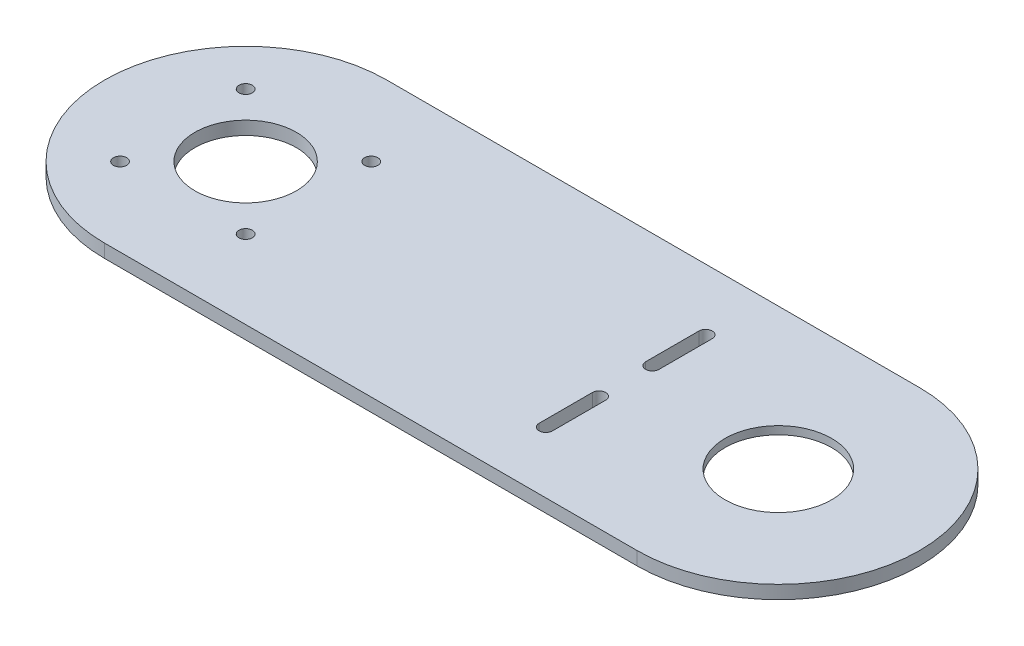
ISO-10303-21;
HEADER;
FILE_DESCRIPTION(('STEP AP214'),'2;1');
FILE_NAME('part.step','',(''),(''),'','','');
FILE_SCHEMA(('AUTOMOTIVE_DESIGN { 1 0 10303 214 1 1 1 1 }'));
ENDSEC;
DATA;
#1=APPLICATION_CONTEXT('core data for automotive mechanical design processes');
#2=APPLICATION_PROTOCOL_DEFINITION('international standard','automotive_design',2000,#1);
#3=PRODUCT_CONTEXT('',#1,'mechanical');
#4=PRODUCT('Part','Part','',(#3));
#5=PRODUCT_RELATED_PRODUCT_CATEGORY('part','',(#4));
#6=PRODUCT_DEFINITION_FORMATION('','',#4);
#7=PRODUCT_DEFINITION_CONTEXT('part definition',#1,'design');
#8=PRODUCT_DEFINITION('design','',#6,#7);
#9=PRODUCT_DEFINITION_SHAPE('','',#8);
#10=(LENGTH_UNIT() NAMED_UNIT(*) SI_UNIT(.MILLI.,.METRE.));
#11=(NAMED_UNIT(*) PLANE_ANGLE_UNIT() SI_UNIT($,.RADIAN.));
#12=(NAMED_UNIT(*) SI_UNIT($,.STERADIAN.) SOLID_ANGLE_UNIT());
#13=UNCERTAINTY_MEASURE_WITH_UNIT(LENGTH_MEASURE(1.E-05),#10,'distance_accuracy_value','');
#14=(GEOMETRIC_REPRESENTATION_CONTEXT(3) GLOBAL_UNCERTAINTY_ASSIGNED_CONTEXT((#13)) GLOBAL_UNIT_ASSIGNED_CONTEXT((#10,
#11,#12)) REPRESENTATION_CONTEXT('',''));
#15=CARTESIAN_POINT('',(0.,0.,0.));
#16=DIRECTION('',(0.,0.,1.));
#17=DIRECTION('',(1.,0.,0.));
#18=AXIS2_PLACEMENT_3D('',#15,#16,#17);
#19=CARTESIAN_POINT('',(100.,0.,0.));
#20=DIRECTION('',(0.,1.,0.));
#21=DIRECTION('',(0.,0.,1.));
#22=AXIS2_PLACEMENT_3D('',#19,#20,#21);
#23=CYLINDRICAL_SURFACE('',#22,20.);
#24=CARTESIAN_POINT('',(100.,5.,0.));
#25=DIRECTION('',(0.,1.,0.));
#26=DIRECTION('',(0.,0.,1.));
#27=AXIS2_PLACEMENT_3D('',#24,#25,#26);
#28=CIRCLE('',#27,20.);
#29=CARTESIAN_POINT('',(100.,5.,20.));
#30=VERTEX_POINT('',#29);
#31=EDGE_CURVE('E210',#30,#30,#28,.T.);
#32=ORIENTED_EDGE('',*,*,#31,.T.);
#33=EDGE_LOOP('',(#32));
#34=FACE_BOUND('',#33,.T.);
#35=CARTESIAN_POINT('',(100.,2.,0.));
#36=DIRECTION('',(0.,-1.,0.));
#37=DIRECTION('',(0.,0.,-1.));
#38=AXIS2_PLACEMENT_3D('',#35,#36,#37);
#39=CIRCLE('',#38,20.);
#40=CARTESIAN_POINT('',(100.,2.,-20.));
#41=VERTEX_POINT('',#40);
#42=EDGE_CURVE('E39',#41,#41,#39,.F.);
#43=ORIENTED_EDGE('',*,*,#42,.F.);
#44=EDGE_LOOP('',(#43));
#45=FACE_BOUND('',#44,.T.);
#46=ADVANCED_FACE('F35',(#34,#45),#23,.F.);
#47=CARTESIAN_POINT('',(-100.,5.,0.));
#48=DIRECTION('',(0.,-1.,0.));
#49=DIRECTION('',(0.,0.,-1.));
#50=AXIS2_PLACEMENT_3D('',#47,#48,#49);
#51=CYLINDRICAL_SURFACE('',#50,53.);
#52=CARTESIAN_POINT('',(-100.,0.,0.));
#53=DIRECTION('',(0.,1.,0.));
#54=DIRECTION('',(0.,0.,1.));
#55=AXIS2_PLACEMENT_3D('',#52,#53,#54);
#56=CIRCLE('',#55,53.);
#57=CARTESIAN_POINT('',(-100.,0.,-53.));
#58=VERTEX_POINT('',#57);
#59=CARTESIAN_POINT('',(-100.,0.,53.));
#60=VERTEX_POINT('',#59);
#61=EDGE_CURVE('E213',#58,#60,#56,.T.);
#62=ORIENTED_EDGE('',*,*,#61,.T.);
#63=DIRECTION('',(0.,-1.,0.));
#64=VECTOR('',#63,1.);
#65=CARTESIAN_POINT('',(-100.,5.,53.));
#66=LINE('',#65,#64);
#67=CARTESIAN_POINT('',(-100.,5.,53.));
#68=VERTEX_POINT('',#67);
#69=EDGE_CURVE('E11',#68,#60,#66,.T.);
#70=ORIENTED_EDGE('',*,*,#69,.F.);
#71=CARTESIAN_POINT('',(-100.,5.,0.));
#72=DIRECTION('',(0.,1.,0.));
#73=DIRECTION('',(0.,0.,1.));
#74=AXIS2_PLACEMENT_3D('',#71,#72,#73);
#75=CIRCLE('',#74,53.);
#76=CARTESIAN_POINT('',(-100.,5.,-53.));
#77=VERTEX_POINT('',#76);
#78=EDGE_CURVE('E214',#77,#68,#75,.T.);
#79=ORIENTED_EDGE('',*,*,#78,.F.);
#80=DIRECTION('',(0.,-1.,0.));
#81=VECTOR('',#80,1.);
#82=CARTESIAN_POINT('',(-100.,5.,-53.));
#83=LINE('',#82,#81);
#84=EDGE_CURVE('E225',#77,#58,#83,.T.);
#85=ORIENTED_EDGE('',*,*,#84,.T.);
#86=EDGE_LOOP('',(#62,#70,#79,#85));
#87=FACE_BOUND('',#86,.T.);
#88=ADVANCED_FACE('F37',(#87),#51,.T.);
#89=CARTESIAN_POINT('',(0.,5.,53.));
#90=DIRECTION('',(0.,0.,-1.));
#91=DIRECTION('',(-1.,0.,0.));
#92=AXIS2_PLACEMENT_3D('',#89,#90,#91);
#93=PLANE('',#92);
#94=DIRECTION('',(1.,0.,0.));
#95=VECTOR('',#94,1.);
#96=CARTESIAN_POINT('',(0.,0.,53.));
#97=LINE('',#96,#95);
#98=CARTESIAN_POINT('',(100.,0.,53.));
#99=VERTEX_POINT('',#98);
#100=EDGE_CURVE('E228',#60,#99,#97,.T.);
#101=ORIENTED_EDGE('',*,*,#100,.T.);
#102=DIRECTION('',(0.,-1.,0.));
#103=VECTOR('',#102,1.);
#104=CARTESIAN_POINT('',(100.,5.,53.));
#105=LINE('',#104,#103);
#106=CARTESIAN_POINT('',(100.,5.,53.));
#107=VERTEX_POINT('',#106);
#108=EDGE_CURVE('E44',#107,#99,#105,.T.);
#109=ORIENTED_EDGE('',*,*,#108,.F.);
#110=DIRECTION('',(1.,0.,0.));
#111=VECTOR('',#110,1.);
#112=CARTESIAN_POINT('',(0.,5.,53.));
#113=LINE('',#112,#111);
#114=EDGE_CURVE('E217',#68,#107,#113,.T.);
#115=ORIENTED_EDGE('',*,*,#114,.F.);
#116=ORIENTED_EDGE('',*,*,#69,.T.);
#117=EDGE_LOOP('',(#101,#109,#115,#116));
#118=FACE_BOUND('',#117,.T.);
#119=ADVANCED_FACE('F256',(#118),#93,.F.);
#120=CARTESIAN_POINT('',(100.,5.,0.));
#121=DIRECTION('',(0.,-1.,0.));
#122=DIRECTION('',(0.,0.,-1.));
#123=AXIS2_PLACEMENT_3D('',#120,#121,#122);
#124=CYLINDRICAL_SURFACE('',#123,53.);
#125=CARTESIAN_POINT('',(100.,0.,0.));
#126=DIRECTION('',(0.,1.,0.));
#127=DIRECTION('',(0.,0.,1.));
#128=AXIS2_PLACEMENT_3D('',#125,#126,#127);
#129=CIRCLE('',#128,53.);
#130=CARTESIAN_POINT('',(100.,0.,-53.));
#131=VERTEX_POINT('',#130);
#132=EDGE_CURVE('E230',#99,#131,#129,.T.);
#133=ORIENTED_EDGE('',*,*,#132,.T.);
#134=DIRECTION('',(0.,-1.,0.));
#135=VECTOR('',#134,1.);
#136=CARTESIAN_POINT('',(100.,5.,-53.));
#137=LINE('',#136,#135);
#138=CARTESIAN_POINT('',(100.,5.,-53.));
#139=VERTEX_POINT('',#138);
#140=EDGE_CURVE('E236',#139,#131,#137,.T.);
#141=ORIENTED_EDGE('',*,*,#140,.F.);
#142=CARTESIAN_POINT('',(100.,5.,0.));
#143=DIRECTION('',(0.,1.,0.));
#144=DIRECTION('',(0.,0.,1.));
#145=AXIS2_PLACEMENT_3D('',#142,#143,#144);
#146=CIRCLE('',#145,53.);
#147=EDGE_CURVE('E220',#107,#139,#146,.T.);
#148=ORIENTED_EDGE('',*,*,#147,.F.);
#149=ORIENTED_EDGE('',*,*,#108,.T.);
#150=EDGE_LOOP('',(#133,#141,#148,#149));
#151=FACE_BOUND('',#150,.T.);
#152=ADVANCED_FACE('F243',(#151),#124,.T.);
#153=CARTESIAN_POINT('',(0.,5.,-53.));
#154=DIRECTION('',(0.,0.,-1.));
#155=DIRECTION('',(-1.,0.,0.));
#156=AXIS2_PLACEMENT_3D('',#153,#154,#155);
#157=PLANE('',#156);
#158=DIRECTION('',(1.,0.,0.));
#159=VECTOR('',#158,1.);
#160=CARTESIAN_POINT('',(0.,0.,-53.));
#161=LINE('',#160,#159);
#162=EDGE_CURVE('E218',#58,#131,#161,.T.);
#163=ORIENTED_EDGE('',*,*,#162,.F.);
#164=ORIENTED_EDGE('',*,*,#84,.F.);
#165=DIRECTION('',(1.,0.,0.));
#166=VECTOR('',#165,1.);
#167=CARTESIAN_POINT('',(0.,5.,-53.));
#168=LINE('',#167,#166);
#169=EDGE_CURVE('E222',#77,#139,#168,.T.);
#170=ORIENTED_EDGE('',*,*,#169,.T.);
#171=ORIENTED_EDGE('',*,*,#140,.T.);
#172=EDGE_LOOP('',(#163,#164,#170,#171));
#173=FACE_BOUND('',#172,.T.);
#174=ADVANCED_FACE('F250',(#173),#157,.T.);
#175=CARTESIAN_POINT('',(0.,5.,0.));
#176=DIRECTION('',(0.,1.,0.));
#177=DIRECTION('',(0.,0.,1.));
#178=AXIS2_PLACEMENT_3D('',#175,#176,#177);
#179=PLANE('',#178);
#180=CARTESIAN_POINT('',(42.6826386405906,5.,10.));
#181=DIRECTION('',(0.,1.,0.));
#182=DIRECTION('',(0.,0.,1.));
#183=AXIS2_PLACEMENT_3D('',#180,#181,#182);
#184=CIRCLE('',#183,2.49999999999999);
#185=CARTESIAN_POINT('',(45.1826386405906,5.,10.));
#186=VERTEX_POINT('',#185);
#187=CARTESIAN_POINT('',(40.1826386405906,5.,10.));
#188=VERTEX_POINT('',#187);
#189=EDGE_CURVE('E51',#186,#188,#184,.T.);
#190=ORIENTED_EDGE('',*,*,#189,.F.);
#191=DIRECTION('',(0.,0.,-1.));
#192=VECTOR('',#191,1.);
#193=CARTESIAN_POINT('',(45.1826386405906,5.,10.));
#194=LINE('',#193,#192);
#195=CARTESIAN_POINT('',(45.1826386405906,5.,30.));
#196=VERTEX_POINT('',#195);
#197=EDGE_CURVE('E172',#196,#186,#194,.T.);
#198=ORIENTED_EDGE('',*,*,#197,.F.);
#199=CARTESIAN_POINT('',(42.6826386405906,5.,30.));
#200=DIRECTION('',(0.,1.,0.));
#201=DIRECTION('',(0.,0.,1.));
#202=AXIS2_PLACEMENT_3D('',#199,#200,#201);
#203=CIRCLE('',#202,2.49999999999999);
#204=CARTESIAN_POINT('',(40.1826386405906,5.,30.));
#205=VERTEX_POINT('',#204);
#206=EDGE_CURVE('E186',#205,#196,#203,.T.);
#207=ORIENTED_EDGE('',*,*,#206,.F.);
#208=DIRECTION('',(0.,0.,1.));
#209=VECTOR('',#208,1.);
#210=CARTESIAN_POINT('',(40.1826386405906,5.,10.));
#211=LINE('',#210,#209);
#212=EDGE_CURVE('E183',#188,#205,#211,.T.);
#213=ORIENTED_EDGE('',*,*,#212,.F.);
#214=EDGE_LOOP('',(#190,#198,#207,#213));
#215=FACE_BOUND('',#214,.T.);
#216=CARTESIAN_POINT('',(42.6826386405906,5.,-30.));
#217=DIRECTION('',(0.,1.,0.));
#218=DIRECTION('',(0.,0.,-1.));
#219=AXIS2_PLACEMENT_3D('',#216,#217,#218);
#220=CIRCLE('',#219,2.49999999999999);
#221=CARTESIAN_POINT('',(45.1826386405906,5.,-30.));
#222=VERTEX_POINT('',#221);
#223=CARTESIAN_POINT('',(40.1826386405906,5.,-30.));
#224=VERTEX_POINT('',#223);
#225=EDGE_CURVE('E59',#222,#224,#220,.T.);
#226=ORIENTED_EDGE('',*,*,#225,.F.);
#227=DIRECTION('',(0.,0.,-1.));
#228=VECTOR('',#227,1.);
#229=CARTESIAN_POINT('',(45.1826386405906,5.,-10.));
#230=LINE('',#229,#228);
#231=CARTESIAN_POINT('',(45.1826386405906,5.,-10.));
#232=VERTEX_POINT('',#231);
#233=EDGE_CURVE('E146',#232,#222,#230,.T.);
#234=ORIENTED_EDGE('',*,*,#233,.F.);
#235=CARTESIAN_POINT('',(42.6826386405906,5.,-10.));
#236=DIRECTION('',(0.,1.,0.));
#237=DIRECTION('',(0.,0.,-1.));
#238=AXIS2_PLACEMENT_3D('',#235,#236,#237);
#239=CIRCLE('',#238,2.49999999999999);
#240=CARTESIAN_POINT('',(40.1826386405906,5.,-10.));
#241=VERTEX_POINT('',#240);
#242=EDGE_CURVE('E149',#241,#232,#239,.T.);
#243=ORIENTED_EDGE('',*,*,#242,.F.);
#244=DIRECTION('',(0.,0.,1.));
#245=VECTOR('',#244,1.);
#246=CARTESIAN_POINT('',(40.1826386405906,5.,-10.));
#247=LINE('',#246,#245);
#248=EDGE_CURVE('E158',#224,#241,#247,.T.);
#249=ORIENTED_EDGE('',*,*,#248,.F.);
#250=EDGE_LOOP('',(#226,#234,#243,#249));
#251=FACE_BOUND('',#250,.T.);
#252=CARTESIAN_POINT('',(-100.,5.,0.));
#253=DIRECTION('',(0.,1.,0.));
#254=DIRECTION('',(0.,0.,1.));
#255=AXIS2_PLACEMENT_3D('',#252,#253,#254);
#256=CIRCLE('',#255,19.05);
#257=CARTESIAN_POINT('',(-100.,5.,19.05));
#258=VERTEX_POINT('',#257);
#259=EDGE_CURVE('E152',#258,#258,#256,.T.);
#260=ORIENTED_EDGE('',*,*,#259,.F.);
#261=EDGE_LOOP('',(#260));
#262=FACE_BOUND('',#261,.T.);
#263=CARTESIAN_POINT('',(-123.57,5.,23.57));
#264=DIRECTION('',(0.,1.,0.));
#265=DIRECTION('',(0.,0.,1.));
#266=AXIS2_PLACEMENT_3D('',#263,#264,#265);
#267=CIRCLE('',#266,2.50000000000001);
#268=CARTESIAN_POINT('',(-123.57,5.,26.07));
#269=VERTEX_POINT('',#268);
#270=EDGE_CURVE('E489',#269,#269,#267,.T.);
#271=ORIENTED_EDGE('',*,*,#270,.F.);
#272=EDGE_LOOP('',(#271));
#273=FACE_BOUND('',#272,.T.);
#274=CARTESIAN_POINT('',(-76.43,5.,23.57));
#275=DIRECTION('',(0.,1.,0.));
#276=DIRECTION('',(0.,0.,1.));
#277=AXIS2_PLACEMENT_3D('',#274,#275,#276);
#278=CIRCLE('',#277,2.5);
#279=CARTESIAN_POINT('',(-76.43,5.,26.07));
#280=VERTEX_POINT('',#279);
#281=EDGE_CURVE('E493',#280,#280,#278,.T.);
#282=ORIENTED_EDGE('',*,*,#281,.F.);
#283=EDGE_LOOP('',(#282));
#284=FACE_BOUND('',#283,.T.);
#285=CARTESIAN_POINT('',(-76.43,5.,-23.57));
#286=DIRECTION('',(0.,1.,0.));
#287=DIRECTION('',(0.,0.,1.));
#288=AXIS2_PLACEMENT_3D('',#285,#286,#287);
#289=CIRCLE('',#288,2.50000000000001);
#290=CARTESIAN_POINT('',(-76.43,5.,-21.07));
#291=VERTEX_POINT('',#290);
#292=EDGE_CURVE('E497',#291,#291,#289,.T.);
#293=ORIENTED_EDGE('',*,*,#292,.F.);
#294=EDGE_LOOP('',(#293));
#295=FACE_BOUND('',#294,.T.);
#296=CARTESIAN_POINT('',(-123.57,5.,-23.57));
#297=DIRECTION('',(0.,1.,0.));
#298=DIRECTION('',(0.,0.,1.));
#299=AXIS2_PLACEMENT_3D('',#296,#297,#298);
#300=CIRCLE('',#299,2.50000000000001);
#301=CARTESIAN_POINT('',(-123.57,5.,-21.07));
#302=VERTEX_POINT('',#301);
#303=EDGE_CURVE('E201',#302,#302,#300,.T.);
#304=ORIENTED_EDGE('',*,*,#303,.F.);
#305=EDGE_LOOP('',(#304));
#306=FACE_BOUND('',#305,.T.);
#307=ORIENTED_EDGE('',*,*,#31,.F.);
#308=EDGE_LOOP('',(#307));
#309=FACE_BOUND('',#308,.T.);
#310=ORIENTED_EDGE('',*,*,#78,.T.);
#311=ORIENTED_EDGE('',*,*,#114,.T.);
#312=ORIENTED_EDGE('',*,*,#147,.T.);
#313=ORIENTED_EDGE('',*,*,#169,.F.);
#314=EDGE_LOOP('',(#310,#311,#312,#313));
#315=FACE_BOUND('',#314,.T.);
#316=ADVANCED_FACE('F254',(#215,#251,#262,#273,#284,#295,#306,#309,#315),#179,.T.);
#317=CARTESIAN_POINT('',(0.,0.,0.));
#318=DIRECTION('',(0.,1.,0.));
#319=DIRECTION('',(0.,0.,1.));
#320=AXIS2_PLACEMENT_3D('',#317,#318,#319);
#321=PLANE('',#320);
#322=DIRECTION('',(0.,0.,-1.));
#323=VECTOR('',#322,1.);
#324=CARTESIAN_POINT('',(45.1826386405906,0.,10.));
#325=LINE('',#324,#323);
#326=CARTESIAN_POINT('',(45.1826386405906,0.,30.));
#327=VERTEX_POINT('',#326);
#328=CARTESIAN_POINT('',(45.1826386405906,0.,10.));
#329=VERTEX_POINT('',#328);
#330=EDGE_CURVE('E178',#327,#329,#325,.T.);
#331=ORIENTED_EDGE('',*,*,#330,.T.);
#332=CARTESIAN_POINT('',(42.6826386405906,0.,10.));
#333=DIRECTION('',(0.,1.,0.));
#334=DIRECTION('',(0.,0.,1.));
#335=AXIS2_PLACEMENT_3D('',#332,#333,#334);
#336=CIRCLE('',#335,2.49999999999999);
#337=CARTESIAN_POINT('',(40.1826386405906,0.,10.));
#338=VERTEX_POINT('',#337);
#339=EDGE_CURVE('E168',#329,#338,#336,.T.);
#340=ORIENTED_EDGE('',*,*,#339,.T.);
#341=DIRECTION('',(0.,0.,1.));
#342=VECTOR('',#341,1.);
#343=CARTESIAN_POINT('',(40.1826386405906,0.,10.));
#344=LINE('',#343,#342);
#345=CARTESIAN_POINT('',(40.1826386405906,0.,30.));
#346=VERTEX_POINT('',#345);
#347=EDGE_CURVE('E171',#338,#346,#344,.T.);
#348=ORIENTED_EDGE('',*,*,#347,.T.);
#349=CARTESIAN_POINT('',(42.6826386405906,0.,30.));
#350=DIRECTION('',(0.,1.,0.));
#351=DIRECTION('',(0.,0.,1.));
#352=AXIS2_PLACEMENT_3D('',#349,#350,#351);
#353=CIRCLE('',#352,2.49999999999999);
#354=EDGE_CURVE('E175',#346,#327,#353,.T.);
#355=ORIENTED_EDGE('',*,*,#354,.T.);
#356=EDGE_LOOP('',(#331,#340,#348,#355));
#357=FACE_BOUND('',#356,.T.);
#358=DIRECTION('',(0.,0.,-1.));
#359=VECTOR('',#358,1.);
#360=CARTESIAN_POINT('',(45.1826386405906,0.,-10.));
#361=LINE('',#360,#359);
#362=CARTESIAN_POINT('',(45.1826386405906,0.,-10.));
#363=VERTEX_POINT('',#362);
#364=CARTESIAN_POINT('',(45.1826386405906,0.,-30.));
#365=VERTEX_POINT('',#364);
#366=EDGE_CURVE('E133',#363,#365,#361,.T.);
#367=ORIENTED_EDGE('',*,*,#366,.T.);
#368=CARTESIAN_POINT('',(42.6826386405906,0.,-30.));
#369=DIRECTION('',(0.,1.,0.));
#370=DIRECTION('',(0.,0.,-1.));
#371=AXIS2_PLACEMENT_3D('',#368,#369,#370);
#372=CIRCLE('',#371,2.49999999999999);
#373=CARTESIAN_POINT('',(40.1826386405906,0.,-30.));
#374=VERTEX_POINT('',#373);
#375=EDGE_CURVE('E127',#365,#374,#372,.T.);
#376=ORIENTED_EDGE('',*,*,#375,.T.);
#377=DIRECTION('',(0.,0.,1.));
#378=VECTOR('',#377,1.);
#379=CARTESIAN_POINT('',(40.1826386405906,0.,-10.));
#380=LINE('',#379,#378);
#381=CARTESIAN_POINT('',(40.1826386405906,0.,-10.));
#382=VERTEX_POINT('',#381);
#383=EDGE_CURVE('E137',#374,#382,#380,.T.);
#384=ORIENTED_EDGE('',*,*,#383,.T.);
#385=CARTESIAN_POINT('',(42.6826386405906,0.,-10.));
#386=DIRECTION('',(0.,1.,0.));
#387=DIRECTION('',(0.,0.,-1.));
#388=AXIS2_PLACEMENT_3D('',#385,#386,#387);
#389=CIRCLE('',#388,2.49999999999999);
#390=EDGE_CURVE('E141',#382,#363,#389,.T.);
#391=ORIENTED_EDGE('',*,*,#390,.T.);
#392=EDGE_LOOP('',(#367,#376,#384,#391));
#393=FACE_BOUND('',#392,.T.);
#394=CARTESIAN_POINT('',(-100.,0.,0.));
#395=DIRECTION('',(0.,1.,0.));
#396=DIRECTION('',(0.,0.,1.));
#397=AXIS2_PLACEMENT_3D('',#394,#395,#396);
#398=CIRCLE('',#397,19.05);
#399=CARTESIAN_POINT('',(-100.,0.,19.05));
#400=VERTEX_POINT('',#399);
#401=EDGE_CURVE('E514',#400,#400,#398,.T.);
#402=ORIENTED_EDGE('',*,*,#401,.T.);
#403=EDGE_LOOP('',(#402));
#404=FACE_BOUND('',#403,.T.);
#405=CARTESIAN_POINT('',(-123.57,0.,23.57));
#406=DIRECTION('',(0.,1.,0.));
#407=DIRECTION('',(0.,0.,1.));
#408=AXIS2_PLACEMENT_3D('',#405,#406,#407);
#409=CIRCLE('',#408,2.50000000000001);
#410=CARTESIAN_POINT('',(-123.57,0.,26.07));
#411=VERTEX_POINT('',#410);
#412=EDGE_CURVE('E511',#411,#411,#409,.T.);
#413=ORIENTED_EDGE('',*,*,#412,.T.);
#414=EDGE_LOOP('',(#413));
#415=FACE_BOUND('',#414,.T.);
#416=CARTESIAN_POINT('',(-76.43,0.,23.57));
#417=DIRECTION('',(0.,1.,0.));
#418=DIRECTION('',(0.,0.,1.));
#419=AXIS2_PLACEMENT_3D('',#416,#417,#418);
#420=CIRCLE('',#419,2.5);
#421=CARTESIAN_POINT('',(-76.43,0.,26.07));
#422=VERTEX_POINT('',#421);
#423=EDGE_CURVE('E503',#422,#422,#420,.T.);
#424=ORIENTED_EDGE('',*,*,#423,.T.);
#425=EDGE_LOOP('',(#424));
#426=FACE_BOUND('',#425,.T.);
#427=CARTESIAN_POINT('',(-76.43,0.,-23.57));
#428=DIRECTION('',(0.,1.,0.));
#429=DIRECTION('',(0.,0.,1.));
#430=AXIS2_PLACEMENT_3D('',#427,#428,#429);
#431=CIRCLE('',#430,2.50000000000001);
#432=CARTESIAN_POINT('',(-76.43,0.,-21.07));
#433=VERTEX_POINT('',#432);
#434=EDGE_CURVE('E204',#433,#433,#431,.T.);
#435=ORIENTED_EDGE('',*,*,#434,.T.);
#436=EDGE_LOOP('',(#435));
#437=FACE_BOUND('',#436,.T.);
#438=CARTESIAN_POINT('',(-123.57,0.,-23.57));
#439=DIRECTION('',(0.,1.,0.));
#440=DIRECTION('',(0.,0.,1.));
#441=AXIS2_PLACEMENT_3D('',#438,#439,#440);
#442=CIRCLE('',#441,2.50000000000001);
#443=CARTESIAN_POINT('',(-123.57,0.,-21.07));
#444=VERTEX_POINT('',#443);
#445=EDGE_CURVE('E197',#444,#444,#442,.T.);
#446=ORIENTED_EDGE('',*,*,#445,.T.);
#447=EDGE_LOOP('',(#446));
#448=FACE_BOUND('',#447,.T.);
#449=CARTESIAN_POINT('',(100.,0.,0.));
#450=DIRECTION('',(0.,-1.,0.));
#451=DIRECTION('',(0.,0.,-1.));
#452=AXIS2_PLACEMENT_3D('',#449,#450,#451);
#453=CIRCLE('',#452,30.);
#454=CARTESIAN_POINT('',(100.,0.,-30.));
#455=VERTEX_POINT('',#454);
#456=EDGE_CURVE('E200',#455,#455,#453,.T.);
#457=ORIENTED_EDGE('',*,*,#456,.F.);
#458=EDGE_LOOP('',(#457));
#459=FACE_BOUND('',#458,.T.);
#460=ORIENTED_EDGE('',*,*,#61,.F.);
#461=ORIENTED_EDGE('',*,*,#162,.T.);
#462=ORIENTED_EDGE('',*,*,#132,.F.);
#463=ORIENTED_EDGE('',*,*,#100,.F.);
#464=EDGE_LOOP('',(#460,#461,#462,#463));
#465=FACE_BOUND('',#464,.T.);
#466=ADVANCED_FACE('F143',(#357,#393,#404,#415,#426,#437,#448,#459,#465),#321,.F.);
#467=CARTESIAN_POINT('',(100.,2.,0.));
#468=DIRECTION('',(0.,-1.,0.));
#469=DIRECTION('',(0.,0.,-1.));
#470=AXIS2_PLACEMENT_3D('',#467,#468,#469);
#471=PLANE('',#470);
#472=CARTESIAN_POINT('',(100.,2.,0.));
#473=DIRECTION('',(0.,-1.,0.));
#474=DIRECTION('',(0.,0.,-1.));
#475=AXIS2_PLACEMENT_3D('',#472,#473,#474);
#476=CIRCLE('',#475,30.);
#477=CARTESIAN_POINT('',(100.,2.,-30.));
#478=VERTEX_POINT('',#477);
#479=EDGE_CURVE('E205',#478,#478,#476,.T.);
#480=ORIENTED_EDGE('',*,*,#479,.T.);
#481=EDGE_LOOP('',(#480));
#482=FACE_BOUND('',#481,.T.);
#483=ORIENTED_EDGE('',*,*,#42,.T.);
#484=EDGE_LOOP('',(#483));
#485=FACE_BOUND('',#484,.T.);
#486=ADVANCED_FACE('F277',(#482,#485),#471,.T.);
#487=CARTESIAN_POINT('',(100.,2.,0.));
#488=DIRECTION('',(0.,-1.,0.));
#489=DIRECTION('',(0.,0.,-1.));
#490=AXIS2_PLACEMENT_3D('',#487,#488,#489);
#491=CYLINDRICAL_SURFACE('',#490,30.);
#492=ORIENTED_EDGE('',*,*,#479,.F.);
#493=EDGE_LOOP('',(#492));
#494=FACE_BOUND('',#493,.T.);
#495=ORIENTED_EDGE('',*,*,#456,.T.);
#496=EDGE_LOOP('',(#495));
#497=FACE_BOUND('',#496,.T.);
#498=ADVANCED_FACE('F270',(#494,#497),#491,.F.);
#499=CARTESIAN_POINT('',(-123.57,0.,-23.57));
#500=DIRECTION('',(0.,1.,0.));
#501=DIRECTION('',(0.,0.,1.));
#502=AXIS2_PLACEMENT_3D('',#499,#500,#501);
#503=CYLINDRICAL_SURFACE('',#502,2.50000000000001);
#504=ORIENTED_EDGE('',*,*,#445,.F.);
#505=EDGE_LOOP('',(#504));
#506=FACE_BOUND('',#505,.T.);
#507=ORIENTED_EDGE('',*,*,#303,.T.);
#508=EDGE_LOOP('',(#507));
#509=FACE_BOUND('',#508,.T.);
#510=ADVANCED_FACE('F311',(#506,#509),#503,.F.);
#511=CARTESIAN_POINT('',(-76.43,0.,-23.57));
#512=DIRECTION('',(0.,1.,0.));
#513=DIRECTION('',(0.,0.,1.));
#514=AXIS2_PLACEMENT_3D('',#511,#512,#513);
#515=CYLINDRICAL_SURFACE('',#514,2.50000000000001);
#516=ORIENTED_EDGE('',*,*,#434,.F.);
#517=EDGE_LOOP('',(#516));
#518=FACE_BOUND('',#517,.T.);
#519=ORIENTED_EDGE('',*,*,#292,.T.);
#520=EDGE_LOOP('',(#519));
#521=FACE_BOUND('',#520,.T.);
#522=ADVANCED_FACE('F317',(#518,#521),#515,.F.);
#523=CARTESIAN_POINT('',(-76.43,0.,23.57));
#524=DIRECTION('',(0.,1.,0.));
#525=DIRECTION('',(0.,0.,1.));
#526=AXIS2_PLACEMENT_3D('',#523,#524,#525);
#527=CYLINDRICAL_SURFACE('',#526,2.5);
#528=ORIENTED_EDGE('',*,*,#423,.F.);
#529=EDGE_LOOP('',(#528));
#530=FACE_BOUND('',#529,.T.);
#531=ORIENTED_EDGE('',*,*,#281,.T.);
#532=EDGE_LOOP('',(#531));
#533=FACE_BOUND('',#532,.T.);
#534=ADVANCED_FACE('F325',(#530,#533),#527,.F.);
#535=CARTESIAN_POINT('',(-123.57,0.,23.57));
#536=DIRECTION('',(0.,1.,0.));
#537=DIRECTION('',(0.,0.,1.));
#538=AXIS2_PLACEMENT_3D('',#535,#536,#537);
#539=CYLINDRICAL_SURFACE('',#538,2.50000000000001);
#540=ORIENTED_EDGE('',*,*,#412,.F.);
#541=EDGE_LOOP('',(#540));
#542=FACE_BOUND('',#541,.T.);
#543=ORIENTED_EDGE('',*,*,#270,.T.);
#544=EDGE_LOOP('',(#543));
#545=FACE_BOUND('',#544,.T.);
#546=ADVANCED_FACE('F333',(#542,#545),#539,.F.);
#547=CARTESIAN_POINT('',(-100.,0.,0.));
#548=DIRECTION('',(0.,1.,0.));
#549=DIRECTION('',(0.,0.,1.));
#550=AXIS2_PLACEMENT_3D('',#547,#548,#549);
#551=CYLINDRICAL_SURFACE('',#550,19.05);
#552=ORIENTED_EDGE('',*,*,#401,.F.);
#553=EDGE_LOOP('',(#552));
#554=FACE_BOUND('',#553,.T.);
#555=ORIENTED_EDGE('',*,*,#259,.T.);
#556=EDGE_LOOP('',(#555));
#557=FACE_BOUND('',#556,.T.);
#558=ADVANCED_FACE('F341',(#554,#557),#551,.F.);
#559=CARTESIAN_POINT('',(42.6826386405906,0.,-30.));
#560=DIRECTION('',(0.,1.,0.));
#561=DIRECTION('',(0.,0.,1.));
#562=AXIS2_PLACEMENT_3D('',#559,#560,#561);
#563=CYLINDRICAL_SURFACE('',#562,2.49999999999999);
#564=ORIENTED_EDGE('',*,*,#225,.T.);
#565=DIRECTION('',(0.,1.,0.));
#566=VECTOR('',#565,1.);
#567=CARTESIAN_POINT('',(40.1826386405906,0.,-30.));
#568=LINE('',#567,#566);
#569=EDGE_CURVE('E123',#374,#224,#568,.T.);
#570=ORIENTED_EDGE('',*,*,#569,.F.);
#571=ORIENTED_EDGE('',*,*,#375,.F.);
#572=DIRECTION('',(0.,1.,0.));
#573=VECTOR('',#572,1.);
#574=CARTESIAN_POINT('',(45.1826386405906,0.,-30.));
#575=LINE('',#574,#573);
#576=EDGE_CURVE('E163',#365,#222,#575,.T.);
#577=ORIENTED_EDGE('',*,*,#576,.T.);
#578=EDGE_LOOP('',(#564,#570,#571,#577));
#579=FACE_BOUND('',#578,.T.);
#580=ADVANCED_FACE('F125',(#579),#563,.F.);
#581=CARTESIAN_POINT('',(45.1826386405906,0.,-10.));
#582=DIRECTION('',(1.,0.,0.));
#583=DIRECTION('',(0.,0.,-1.));
#584=AXIS2_PLACEMENT_3D('',#581,#582,#583);
#585=PLANE('',#584);
#586=ORIENTED_EDGE('',*,*,#233,.T.);
#587=ORIENTED_EDGE('',*,*,#576,.F.);
#588=ORIENTED_EDGE('',*,*,#366,.F.);
#589=DIRECTION('',(0.,1.,0.));
#590=VECTOR('',#589,1.);
#591=CARTESIAN_POINT('',(45.1826386405906,0.,-10.));
#592=LINE('',#591,#590);
#593=EDGE_CURVE('E165',#363,#232,#592,.T.);
#594=ORIENTED_EDGE('',*,*,#593,.T.);
#595=EDGE_LOOP('',(#586,#587,#588,#594));
#596=FACE_BOUND('',#595,.T.);
#597=ADVANCED_FACE('F356',(#596),#585,.F.);
#598=CARTESIAN_POINT('',(42.6826386405906,0.,-10.));
#599=DIRECTION('',(0.,1.,0.));
#600=DIRECTION('',(0.,0.,1.));
#601=AXIS2_PLACEMENT_3D('',#598,#599,#600);
#602=CYLINDRICAL_SURFACE('',#601,2.49999999999999);
#603=ORIENTED_EDGE('',*,*,#242,.T.);
#604=ORIENTED_EDGE('',*,*,#593,.F.);
#605=ORIENTED_EDGE('',*,*,#390,.F.);
#606=DIRECTION('',(0.,1.,0.));
#607=VECTOR('',#606,1.);
#608=CARTESIAN_POINT('',(40.1826386405906,0.,-10.));
#609=LINE('',#608,#607);
#610=EDGE_CURVE('E132',#382,#241,#609,.T.);
#611=ORIENTED_EDGE('',*,*,#610,.T.);
#612=EDGE_LOOP('',(#603,#604,#605,#611));
#613=FACE_BOUND('',#612,.T.);
#614=ADVANCED_FACE('F363',(#613),#602,.F.);
#615=CARTESIAN_POINT('',(40.1826386405906,0.,-10.));
#616=DIRECTION('',(-1.,0.,0.));
#617=DIRECTION('',(0.,0.,1.));
#618=AXIS2_PLACEMENT_3D('',#615,#616,#617);
#619=PLANE('',#618);
#620=ORIENTED_EDGE('',*,*,#248,.T.);
#621=ORIENTED_EDGE('',*,*,#610,.F.);
#622=ORIENTED_EDGE('',*,*,#383,.F.);
#623=ORIENTED_EDGE('',*,*,#569,.T.);
#624=EDGE_LOOP('',(#620,#621,#622,#623));
#625=FACE_BOUND('',#624,.T.);
#626=ADVANCED_FACE('F138',(#625),#619,.F.);
#627=CARTESIAN_POINT('',(42.6826386405906,0.,10.));
#628=DIRECTION('',(0.,1.,0.));
#629=DIRECTION('',(0.,0.,1.));
#630=AXIS2_PLACEMENT_3D('',#627,#628,#629);
#631=CYLINDRICAL_SURFACE('',#630,2.49999999999999);
#632=ORIENTED_EDGE('',*,*,#189,.T.);
#633=DIRECTION('',(0.,1.,0.));
#634=VECTOR('',#633,1.);
#635=CARTESIAN_POINT('',(40.1826386405906,0.,10.));
#636=LINE('',#635,#634);
#637=EDGE_CURVE('E181',#338,#188,#636,.T.);
#638=ORIENTED_EDGE('',*,*,#637,.F.);
#639=ORIENTED_EDGE('',*,*,#339,.F.);
#640=DIRECTION('',(0.,1.,0.));
#641=VECTOR('',#640,1.);
#642=CARTESIAN_POINT('',(45.1826386405906,0.,10.));
#643=LINE('',#642,#641);
#644=EDGE_CURVE('E159',#329,#186,#643,.T.);
#645=ORIENTED_EDGE('',*,*,#644,.T.);
#646=EDGE_LOOP('',(#632,#638,#639,#645));
#647=FACE_BOUND('',#646,.T.);
#648=ADVANCED_FACE('F378',(#647),#631,.F.);
#649=CARTESIAN_POINT('',(45.1826386405906,0.,10.));
#650=DIRECTION('',(1.,0.,0.));
#651=DIRECTION('',(0.,0.,-1.));
#652=AXIS2_PLACEMENT_3D('',#649,#650,#651);
#653=PLANE('',#652);
#654=ORIENTED_EDGE('',*,*,#197,.T.);
#655=ORIENTED_EDGE('',*,*,#644,.F.);
#656=ORIENTED_EDGE('',*,*,#330,.F.);
#657=DIRECTION('',(0.,1.,0.));
#658=VECTOR('',#657,1.);
#659=CARTESIAN_POINT('',(45.1826386405906,0.,30.));
#660=LINE('',#659,#658);
#661=EDGE_CURVE('E192',#327,#196,#660,.T.);
#662=ORIENTED_EDGE('',*,*,#661,.T.);
#663=EDGE_LOOP('',(#654,#655,#656,#662));
#664=FACE_BOUND('',#663,.T.);
#665=ADVANCED_FACE('F385',(#664),#653,.F.);
#666=CARTESIAN_POINT('',(42.6826386405906,0.,30.));
#667=DIRECTION('',(0.,1.,0.));
#668=DIRECTION('',(0.,0.,1.));
#669=AXIS2_PLACEMENT_3D('',#666,#667,#668);
#670=CYLINDRICAL_SURFACE('',#669,2.49999999999999);
#671=ORIENTED_EDGE('',*,*,#206,.T.);
#672=ORIENTED_EDGE('',*,*,#661,.F.);
#673=ORIENTED_EDGE('',*,*,#354,.F.);
#674=DIRECTION('',(0.,1.,0.));
#675=VECTOR('',#674,1.);
#676=CARTESIAN_POINT('',(40.1826386405906,0.,30.));
#677=LINE('',#676,#675);
#678=EDGE_CURVE('E194',#346,#205,#677,.T.);
#679=ORIENTED_EDGE('',*,*,#678,.T.);
#680=EDGE_LOOP('',(#671,#672,#673,#679));
#681=FACE_BOUND('',#680,.T.);
#682=ADVANCED_FACE('F392',(#681),#670,.F.);
#683=CARTESIAN_POINT('',(40.1826386405906,0.,10.));
#684=DIRECTION('',(-1.,0.,0.));
#685=DIRECTION('',(0.,0.,1.));
#686=AXIS2_PLACEMENT_3D('',#683,#684,#685);
#687=PLANE('',#686);
#688=ORIENTED_EDGE('',*,*,#212,.T.);
#689=ORIENTED_EDGE('',*,*,#678,.F.);
#690=ORIENTED_EDGE('',*,*,#347,.F.);
#691=ORIENTED_EDGE('',*,*,#637,.T.);
#692=EDGE_LOOP('',(#688,#689,#690,#691));
#693=FACE_BOUND('',#692,.T.);
#694=ADVANCED_FACE('F400',(#693),#687,.F.);
#695=CLOSED_SHELL('',(#46,#88,#119,#152,#174,#316,#466,#486,#498,#510,#522,#534,#546,#558,#580,
#597,#614,#626,#648,#665,#682,#694));
#696=MANIFOLD_SOLID_BREP('B2',#695);
#697=ADVANCED_BREP_SHAPE_REPRESENTATION('',(#18,#696),#14);
#698=SHAPE_DEFINITION_REPRESENTATION(#9,#697);
ENDSEC;
END-ISO-10303-21;
